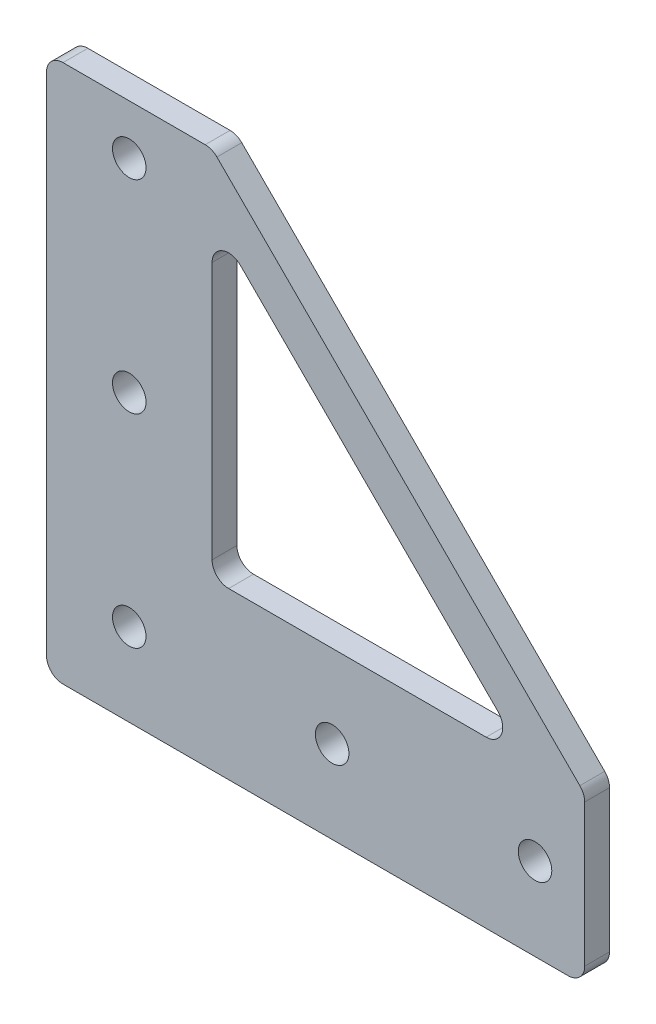
ISO-10303-21;
HEADER;
FILE_DESCRIPTION(('STEP AP214'),'2;1');
FILE_NAME('part.step','',(''),(''),'','','');
FILE_SCHEMA(('AUTOMOTIVE_DESIGN { 1 0 10303 214 1 1 1 1 }'));
ENDSEC;
DATA;
#1=APPLICATION_CONTEXT('core data for automotive mechanical design processes');
#2=APPLICATION_PROTOCOL_DEFINITION('international standard','automotive_design',2000,#1);
#3=PRODUCT_CONTEXT('',#1,'mechanical');
#4=PRODUCT('Part','Part','',(#3));
#5=PRODUCT_RELATED_PRODUCT_CATEGORY('part','',(#4));
#6=PRODUCT_DEFINITION_FORMATION('','',#4);
#7=PRODUCT_DEFINITION_CONTEXT('part definition',#1,'design');
#8=PRODUCT_DEFINITION('design','',#6,#7);
#9=PRODUCT_DEFINITION_SHAPE('','',#8);
#10=(LENGTH_UNIT() NAMED_UNIT(*) SI_UNIT(.MILLI.,.METRE.));
#11=(NAMED_UNIT(*) PLANE_ANGLE_UNIT() SI_UNIT($,.RADIAN.));
#12=(NAMED_UNIT(*) SI_UNIT($,.STERADIAN.) SOLID_ANGLE_UNIT());
#13=UNCERTAINTY_MEASURE_WITH_UNIT(LENGTH_MEASURE(1.E-05),#10,'distance_accuracy_value','');
#14=(GEOMETRIC_REPRESENTATION_CONTEXT(3) GLOBAL_UNCERTAINTY_ASSIGNED_CONTEXT((#13)) GLOBAL_UNIT_ASSIGNED_CONTEXT((#10,
#11,#12)) REPRESENTATION_CONTEXT('',''));
#15=CARTESIAN_POINT('',(0.,0.,0.));
#16=DIRECTION('',(0.,0.,1.));
#17=DIRECTION('',(1.,0.,0.));
#18=AXIS2_PLACEMENT_3D('',#15,#16,#17);
#19=CARTESIAN_POINT('',(65.,0.,3.));
#20=DIRECTION('',(0.,1.,0.));
#21=DIRECTION('',(-1.,0.,0.));
#22=AXIS2_PLACEMENT_3D('',#19,#20,#21);
#23=PLANE('',#22);
#24=DIRECTION('',(1.,0.,0.));
#25=VECTOR('',#24,1.);
#26=CARTESIAN_POINT('',(65.,0.,3.));
#27=LINE('',#26,#25);
#28=CARTESIAN_POINT('',(2.,0.,3.));
#29=VERTEX_POINT('',#28);
#30=CARTESIAN_POINT('',(63.,0.,3.));
#31=VERTEX_POINT('',#30);
#32=EDGE_CURVE('E185',#29,#31,#27,.T.);
#33=ORIENTED_EDGE('',*,*,#32,.F.);
#34=DIRECTION('',(0.,0.,-1.));
#35=VECTOR('',#34,1.);
#36=CARTESIAN_POINT('',(2.,0.,3.));
#37=LINE('',#36,#35);
#38=CARTESIAN_POINT('',(2.,0.,0.));
#39=VERTEX_POINT('',#38);
#40=EDGE_CURVE('E198',#29,#39,#37,.T.);
#41=ORIENTED_EDGE('',*,*,#40,.T.);
#42=DIRECTION('',(1.,0.,0.));
#43=VECTOR('',#42,1.);
#44=CARTESIAN_POINT('',(65.,0.,0.));
#45=LINE('',#44,#43);
#46=CARTESIAN_POINT('',(63.,0.,0.));
#47=VERTEX_POINT('',#46);
#48=EDGE_CURVE('E279',#39,#47,#45,.T.);
#49=ORIENTED_EDGE('',*,*,#48,.T.);
#50=DIRECTION('',(0.,0.,-1.));
#51=VECTOR('',#50,1.);
#52=CARTESIAN_POINT('',(63.,0.,3.));
#53=LINE('',#52,#51);
#54=EDGE_CURVE('E196',#47,#31,#53,.F.);
#55=ORIENTED_EDGE('',*,*,#54,.T.);
#56=EDGE_LOOP('',(#33,#41,#49,#55));
#57=FACE_BOUND('',#56,.T.);
#58=ADVANCED_FACE('F35',(#57),#23,.F.);
#59=CARTESIAN_POINT('',(65.,20.,3.));
#60=DIRECTION('',(-1.,0.,0.));
#61=DIRECTION('',(0.,-1.,0.));
#62=AXIS2_PLACEMENT_3D('',#59,#60,#61);
#63=PLANE('',#62);
#64=DIRECTION('',(0.,1.,0.));
#65=VECTOR('',#64,1.);
#66=CARTESIAN_POINT('',(65.,20.,3.));
#67=LINE('',#66,#65);
#68=CARTESIAN_POINT('',(65.,2.,3.));
#69=VERTEX_POINT('',#68);
#70=CARTESIAN_POINT('',(65.,19.1715728752538,3.));
#71=VERTEX_POINT('',#70);
#72=EDGE_CURVE('E268',#69,#71,#67,.T.);
#73=ORIENTED_EDGE('',*,*,#72,.F.);
#74=DIRECTION('',(0.,0.,-1.));
#75=VECTOR('',#74,1.);
#76=CARTESIAN_POINT('',(65.,2.,3.));
#77=LINE('',#76,#75);
#78=CARTESIAN_POINT('',(65.,2.,0.));
#79=VERTEX_POINT('',#78);
#80=EDGE_CURVE('E236',#69,#79,#77,.T.);
#81=ORIENTED_EDGE('',*,*,#80,.T.);
#82=DIRECTION('',(0.,1.,0.));
#83=VECTOR('',#82,1.);
#84=CARTESIAN_POINT('',(65.,20.,0.));
#85=LINE('',#84,#83);
#86=CARTESIAN_POINT('',(65.,19.1715728752538,0.));
#87=VERTEX_POINT('',#86);
#88=EDGE_CURVE('E180',#79,#87,#85,.T.);
#89=ORIENTED_EDGE('',*,*,#88,.T.);
#90=DIRECTION('',(0.,0.,-1.));
#91=VECTOR('',#90,1.);
#92=CARTESIAN_POINT('',(65.,19.1715728752538,3.));
#93=LINE('',#92,#91);
#94=EDGE_CURVE('E234',#87,#71,#93,.F.);
#95=ORIENTED_EDGE('',*,*,#94,.T.);
#96=EDGE_LOOP('',(#73,#81,#89,#95));
#97=FACE_BOUND('',#96,.T.);
#98=ADVANCED_FACE('F287',(#97),#63,.F.);
#99=CARTESIAN_POINT('',(20.,20.,3.));
#100=DIRECTION('',(0.,-1.,0.));
#101=DIRECTION('',(0.,0.,-1.));
#102=AXIS2_PLACEMENT_3D('',#99,#100,#101);
#103=PLANE('',#102);
#104=DIRECTION('',(-1.,0.,0.));
#105=VECTOR('',#104,1.);
#106=CARTESIAN_POINT('',(20.,20.,3.));
#107=LINE('',#106,#105);
#108=CARTESIAN_POINT('',(53.1005050633883,20.,3.));
#109=VERTEX_POINT('',#108);
#110=CARTESIAN_POINT('',(22.,20.,3.));
#111=VERTEX_POINT('',#110);
#112=EDGE_CURVE('E264',#109,#111,#107,.T.);
#113=ORIENTED_EDGE('',*,*,#112,.F.);
#114=DIRECTION('',(0.,0.,1.));
#115=VECTOR('',#114,1.);
#116=CARTESIAN_POINT('',(53.1005050633883,20.,3.));
#117=LINE('',#116,#115);
#118=CARTESIAN_POINT('',(53.1005050633883,20.,0.));
#119=VERTEX_POINT('',#118);
#120=EDGE_CURVE('E194',#109,#119,#117,.F.);
#121=ORIENTED_EDGE('',*,*,#120,.T.);
#122=DIRECTION('',(-1.,0.,0.));
#123=VECTOR('',#122,1.);
#124=CARTESIAN_POINT('',(20.,20.,0.));
#125=LINE('',#124,#123);
#126=CARTESIAN_POINT('',(22.,20.,0.));
#127=VERTEX_POINT('',#126);
#128=EDGE_CURVE('E176',#119,#127,#125,.T.);
#129=ORIENTED_EDGE('',*,*,#128,.T.);
#130=DIRECTION('',(0.,0.,-1.));
#131=VECTOR('',#130,1.);
#132=CARTESIAN_POINT('',(22.,20.,3.));
#133=LINE('',#132,#131);
#134=EDGE_CURVE('E152',#127,#111,#133,.F.);
#135=ORIENTED_EDGE('',*,*,#134,.T.);
#136=EDGE_LOOP('',(#113,#121,#129,#135));
#137=FACE_BOUND('',#136,.T.);
#138=ADVANCED_FACE('F267',(#137),#103,.F.);
#139=CARTESIAN_POINT('',(20.,65.,3.));
#140=DIRECTION('',(-1.,0.,0.));
#141=DIRECTION('',(0.,-1.,0.));
#142=AXIS2_PLACEMENT_3D('',#139,#140,#141);
#143=PLANE('',#142);
#144=DIRECTION('',(0.,1.,0.));
#145=VECTOR('',#144,1.);
#146=CARTESIAN_POINT('',(20.,65.,0.));
#147=LINE('',#146,#145);
#148=CARTESIAN_POINT('',(20.,22.,0.));
#149=VERTEX_POINT('',#148);
#150=CARTESIAN_POINT('',(20.,53.1005050633883,0.));
#151=VERTEX_POINT('',#150);
#152=EDGE_CURVE('E163',#149,#151,#147,.T.);
#153=ORIENTED_EDGE('',*,*,#152,.T.);
#154=DIRECTION('',(0.,0.,1.));
#155=VECTOR('',#154,1.);
#156=CARTESIAN_POINT('',(20.,53.1005050633883,3.));
#157=LINE('',#156,#155);
#158=CARTESIAN_POINT('',(20.,53.1005050633883,3.));
#159=VERTEX_POINT('',#158);
#160=EDGE_CURVE('E167',#151,#159,#157,.T.);
#161=ORIENTED_EDGE('',*,*,#160,.T.);
#162=DIRECTION('',(0.,1.,0.));
#163=VECTOR('',#162,1.);
#164=CARTESIAN_POINT('',(20.,65.,3.));
#165=LINE('',#164,#163);
#166=CARTESIAN_POINT('',(20.,22.,3.));
#167=VERTEX_POINT('',#166);
#168=EDGE_CURVE('E166',#167,#159,#165,.T.);
#169=ORIENTED_EDGE('',*,*,#168,.F.);
#170=DIRECTION('',(0.,0.,-1.));
#171=VECTOR('',#170,1.);
#172=CARTESIAN_POINT('',(20.,22.,0.));
#173=LINE('',#172,#171);
#174=EDGE_CURVE('E151',#167,#149,#173,.T.);
#175=ORIENTED_EDGE('',*,*,#174,.T.);
#176=EDGE_LOOP('',(#153,#161,#169,#175));
#177=FACE_BOUND('',#176,.T.);
#178=ADVANCED_FACE('F161',(#177),#143,.F.);
#179=CARTESIAN_POINT('',(0.,65.,3.));
#180=DIRECTION('',(0.,-1.,0.));
#181=DIRECTION('',(0.,0.,-1.));
#182=AXIS2_PLACEMENT_3D('',#179,#180,#181);
#183=PLANE('',#182);
#184=DIRECTION('',(-1.,0.,0.));
#185=VECTOR('',#184,1.);
#186=CARTESIAN_POINT('',(0.,65.,0.));
#187=LINE('',#186,#185);
#188=CARTESIAN_POINT('',(19.1715728752538,65.,0.));
#189=VERTEX_POINT('',#188);
#190=CARTESIAN_POINT('',(2.,65.,0.));
#191=VERTEX_POINT('',#190);
#192=EDGE_CURVE('E175',#189,#191,#187,.T.);
#193=ORIENTED_EDGE('',*,*,#192,.T.);
#194=DIRECTION('',(0.,0.,-1.));
#195=VECTOR('',#194,1.);
#196=CARTESIAN_POINT('',(2.,65.,3.));
#197=LINE('',#196,#195);
#198=CARTESIAN_POINT('',(2.,65.,3.));
#199=VERTEX_POINT('',#198);
#200=EDGE_CURVE('E50',#191,#199,#197,.F.);
#201=ORIENTED_EDGE('',*,*,#200,.T.);
#202=DIRECTION('',(-1.,0.,0.));
#203=VECTOR('',#202,1.);
#204=CARTESIAN_POINT('',(0.,65.,3.));
#205=LINE('',#204,#203);
#206=CARTESIAN_POINT('',(19.1715728752538,65.,3.));
#207=VERTEX_POINT('',#206);
#208=EDGE_CURVE('E270',#207,#199,#205,.T.);
#209=ORIENTED_EDGE('',*,*,#208,.F.);
#210=DIRECTION('',(0.,0.,-1.));
#211=VECTOR('',#210,1.);
#212=CARTESIAN_POINT('',(19.1715728752538,65.,0.));
#213=LINE('',#212,#211);
#214=EDGE_CURVE('E225',#207,#189,#213,.T.);
#215=ORIENTED_EDGE('',*,*,#214,.T.);
#216=EDGE_LOOP('',(#193,#201,#209,#215));
#217=FACE_BOUND('',#216,.T.);
#218=ADVANCED_FACE('F354',(#217),#183,.F.);
#219=CARTESIAN_POINT('',(0.,0.,3.));
#220=DIRECTION('',(1.,0.,0.));
#221=DIRECTION('',(0.,0.,-1.));
#222=AXIS2_PLACEMENT_3D('',#219,#220,#221);
#223=PLANE('',#222);
#224=DIRECTION('',(0.,-1.,0.));
#225=VECTOR('',#224,1.);
#226=CARTESIAN_POINT('',(0.,0.,0.));
#227=LINE('',#226,#225);
#228=CARTESIAN_POINT('',(0.,63.,0.));
#229=VERTEX_POINT('',#228);
#230=CARTESIAN_POINT('',(0.,2.,0.));
#231=VERTEX_POINT('',#230);
#232=EDGE_CURVE('E178',#229,#231,#227,.T.);
#233=ORIENTED_EDGE('',*,*,#232,.T.);
#234=DIRECTION('',(0.,0.,-1.));
#235=VECTOR('',#234,1.);
#236=CARTESIAN_POINT('',(0.,2.,3.));
#237=LINE('',#236,#235);
#238=CARTESIAN_POINT('',(0.,2.,3.));
#239=VERTEX_POINT('',#238);
#240=EDGE_CURVE('E214',#231,#239,#237,.F.);
#241=ORIENTED_EDGE('',*,*,#240,.T.);
#242=DIRECTION('',(0.,-1.,0.));
#243=VECTOR('',#242,1.);
#244=CARTESIAN_POINT('',(0.,0.,3.));
#245=LINE('',#244,#243);
#246=CARTESIAN_POINT('',(0.,63.,3.));
#247=VERTEX_POINT('',#246);
#248=EDGE_CURVE('E168',#247,#239,#245,.T.);
#249=ORIENTED_EDGE('',*,*,#248,.F.);
#250=DIRECTION('',(0.,0.,-1.));
#251=VECTOR('',#250,1.);
#252=CARTESIAN_POINT('',(0.,63.,3.));
#253=LINE('',#252,#251);
#254=EDGE_CURVE('E211',#247,#229,#253,.T.);
#255=ORIENTED_EDGE('',*,*,#254,.T.);
#256=EDGE_LOOP('',(#233,#241,#249,#255));
#257=FACE_BOUND('',#256,.T.);
#258=ADVANCED_FACE('F347',(#257),#223,.F.);
#259=CARTESIAN_POINT('',(0.,0.,3.));
#260=DIRECTION('',(0.,0.,-1.));
#261=DIRECTION('',(-1.,0.,0.));
#262=AXIS2_PLACEMENT_3D('',#259,#260,#261);
#263=PLANE('',#262);
#264=ORIENTED_EDGE('',*,*,#168,.T.);
#265=CARTESIAN_POINT('',(22.,53.1005050633883,3.));
#266=DIRECTION('',(0.,0.,-1.));
#267=DIRECTION('',(-1.,0.,0.));
#268=AXIS2_PLACEMENT_3D('',#265,#266,#267);
#269=CIRCLE('',#268,2.);
#270=CARTESIAN_POINT('',(23.4142135623731,54.5147186257614,3.));
#271=VERTEX_POINT('',#270);
#272=EDGE_CURVE('E239',#159,#271,#269,.T.);
#273=ORIENTED_EDGE('',*,*,#272,.T.);
#274=DIRECTION('',(0.707106781186548,-0.707106781186548,0.));
#275=VECTOR('',#274,1.);
#276=CARTESIAN_POINT('',(57.9289321881345,20.,3.));
#277=LINE('',#276,#275);
#278=CARTESIAN_POINT('',(54.5147186257614,23.4142135623731,3.));
#279=VERTEX_POINT('',#278);
#280=EDGE_CURVE('E265',#271,#279,#277,.T.);
#281=ORIENTED_EDGE('',*,*,#280,.T.);
#282=CARTESIAN_POINT('',(53.1005050633883,22.,3.));
#283=DIRECTION('',(0.,0.,-1.));
#284=DIRECTION('',(-1.,0.,0.));
#285=AXIS2_PLACEMENT_3D('',#282,#283,#284);
#286=CIRCLE('',#285,2.);
#287=EDGE_CURVE('E242',#279,#109,#286,.T.);
#288=ORIENTED_EDGE('',*,*,#287,.T.);
#289=ORIENTED_EDGE('',*,*,#112,.T.);
#290=CARTESIAN_POINT('',(22.,22.,3.));
#291=DIRECTION('',(0.,0.,-1.));
#292=DIRECTION('',(-1.,0.,0.));
#293=AXIS2_PLACEMENT_3D('',#290,#291,#292);
#294=CIRCLE('',#293,2.);
#295=EDGE_CURVE('E11',#111,#167,#294,.T.);
#296=ORIENTED_EDGE('',*,*,#295,.T.);
#297=EDGE_LOOP('',(#264,#273,#281,#288,#289,#296));
#298=FACE_BOUND('',#297,.T.);
#299=CARTESIAN_POINT('',(10.,59.,3.));
#300=DIRECTION('',(0.,0.,1.));
#301=DIRECTION('',(1.,0.,0.));
#302=AXIS2_PLACEMENT_3D('',#299,#300,#301);
#303=CIRCLE('',#302,2.025);
#304=CARTESIAN_POINT('',(12.025,59.,3.));
#305=VERTEX_POINT('',#304);
#306=EDGE_CURVE('E307',#305,#305,#303,.T.);
#307=ORIENTED_EDGE('',*,*,#306,.F.);
#308=EDGE_LOOP('',(#307));
#309=FACE_BOUND('',#308,.T.);
#310=CARTESIAN_POINT('',(10.,34.5,3.));
#311=DIRECTION('',(0.,0.,1.));
#312=DIRECTION('',(1.,0.,0.));
#313=AXIS2_PLACEMENT_3D('',#310,#311,#312);
#314=CIRCLE('',#313,2.025);
#315=CARTESIAN_POINT('',(12.025,34.5,3.));
#316=VERTEX_POINT('',#315);
#317=EDGE_CURVE('E313',#316,#316,#314,.T.);
#318=ORIENTED_EDGE('',*,*,#317,.F.);
#319=EDGE_LOOP('',(#318));
#320=FACE_BOUND('',#319,.T.);
#321=CARTESIAN_POINT('',(10.,10.,3.));
#322=DIRECTION('',(0.,0.,1.));
#323=DIRECTION('',(1.,0.,0.));
#324=AXIS2_PLACEMENT_3D('',#321,#322,#323);
#325=CIRCLE('',#324,2.025);
#326=CARTESIAN_POINT('',(12.025,10.,3.));
#327=VERTEX_POINT('',#326);
#328=EDGE_CURVE('E319',#327,#327,#325,.T.);
#329=ORIENTED_EDGE('',*,*,#328,.F.);
#330=EDGE_LOOP('',(#329));
#331=FACE_BOUND('',#330,.T.);
#332=CARTESIAN_POINT('',(34.5,10.,3.));
#333=DIRECTION('',(0.,0.,1.));
#334=DIRECTION('',(1.,0.,0.));
#335=AXIS2_PLACEMENT_3D('',#332,#333,#334);
#336=CIRCLE('',#335,2.025);
#337=CARTESIAN_POINT('',(36.525,10.,3.));
#338=VERTEX_POINT('',#337);
#339=EDGE_CURVE('E325',#338,#338,#336,.T.);
#340=ORIENTED_EDGE('',*,*,#339,.F.);
#341=EDGE_LOOP('',(#340));
#342=FACE_BOUND('',#341,.T.);
#343=CARTESIAN_POINT('',(59.,10.,3.));
#344=DIRECTION('',(0.,0.,1.));
#345=DIRECTION('',(1.,0.,0.));
#346=AXIS2_PLACEMENT_3D('',#343,#344,#345);
#347=CIRCLE('',#346,2.02499999999999);
#348=CARTESIAN_POINT('',(61.025,10.,3.));
#349=VERTEX_POINT('',#348);
#350=EDGE_CURVE('E304',#349,#349,#347,.T.);
#351=ORIENTED_EDGE('',*,*,#350,.F.);
#352=EDGE_LOOP('',(#351));
#353=FACE_BOUND('',#352,.T.);
#354=ORIENTED_EDGE('',*,*,#248,.T.);
#355=CARTESIAN_POINT('',(2.,2.,3.));
#356=DIRECTION('',(0.,0.,-1.));
#357=DIRECTION('',(-1.,0.,0.));
#358=AXIS2_PLACEMENT_3D('',#355,#356,#357);
#359=CIRCLE('',#358,2.);
#360=EDGE_CURVE('E223',#239,#29,#359,.F.);
#361=ORIENTED_EDGE('',*,*,#360,.T.);
#362=ORIENTED_EDGE('',*,*,#32,.T.);
#363=CARTESIAN_POINT('',(63.,2.,3.));
#364=DIRECTION('',(0.,0.,-1.));
#365=DIRECTION('',(-1.,0.,0.));
#366=AXIS2_PLACEMENT_3D('',#363,#364,#365);
#367=CIRCLE('',#366,2.);
#368=EDGE_CURVE('E218',#31,#69,#367,.F.);
#369=ORIENTED_EDGE('',*,*,#368,.T.);
#370=ORIENTED_EDGE('',*,*,#72,.T.);
#371=CARTESIAN_POINT('',(63.,19.1715728752538,3.));
#372=DIRECTION('',(0.,0.,-1.));
#373=DIRECTION('',(-1.,0.,0.));
#374=AXIS2_PLACEMENT_3D('',#371,#372,#373);
#375=CIRCLE('',#374,2.);
#376=CARTESIAN_POINT('',(64.4142135623731,20.5857864376269,3.));
#377=VERTEX_POINT('',#376);
#378=EDGE_CURVE('E216',#71,#377,#375,.F.);
#379=ORIENTED_EDGE('',*,*,#378,.T.);
#380=DIRECTION('',(-0.707106781186547,0.707106781186548,0.));
#381=VECTOR('',#380,1.);
#382=CARTESIAN_POINT('',(20.,65.,3.));
#383=LINE('',#382,#381);
#384=CARTESIAN_POINT('',(20.5857864376269,64.4142135623731,3.));
#385=VERTEX_POINT('',#384);
#386=EDGE_CURVE('E256',#377,#385,#383,.T.);
#387=ORIENTED_EDGE('',*,*,#386,.T.);
#388=CARTESIAN_POINT('',(19.1715728752538,63.,3.));
#389=DIRECTION('',(0.,0.,-1.));
#390=DIRECTION('',(-1.,0.,0.));
#391=AXIS2_PLACEMENT_3D('',#388,#389,#390);
#392=CIRCLE('',#391,2.);
#393=EDGE_CURVE('E57',#385,#207,#392,.F.);
#394=ORIENTED_EDGE('',*,*,#393,.T.);
#395=ORIENTED_EDGE('',*,*,#208,.T.);
#396=CARTESIAN_POINT('',(2.,63.,3.));
#397=DIRECTION('',(0.,0.,-1.));
#398=DIRECTION('',(-1.,0.,0.));
#399=AXIS2_PLACEMENT_3D('',#396,#397,#398);
#400=CIRCLE('',#399,2.);
#401=EDGE_CURVE('E221',#199,#247,#400,.F.);
#402=ORIENTED_EDGE('',*,*,#401,.T.);
#403=EDGE_LOOP('',(#354,#361,#362,#369,#370,#379,#387,#394,#395,#402));
#404=FACE_BOUND('',#403,.T.);
#405=ADVANCED_FACE('F262',(#298,#309,#320,#331,#342,#353,#404),#263,.F.);
#406=CARTESIAN_POINT('',(0.,0.,0.));
#407=DIRECTION('',(0.,0.,-1.));
#408=DIRECTION('',(-1.,0.,0.));
#409=AXIS2_PLACEMENT_3D('',#406,#407,#408);
#410=PLANE('',#409);
#411=ORIENTED_EDGE('',*,*,#128,.F.);
#412=CARTESIAN_POINT('',(53.1005050633883,22.,0.));
#413=DIRECTION('',(0.,0.,-1.));
#414=DIRECTION('',(-1.,0.,0.));
#415=AXIS2_PLACEMENT_3D('',#412,#413,#414);
#416=CIRCLE('',#415,2.);
#417=CARTESIAN_POINT('',(54.5147186257614,23.4142135623731,0.));
#418=VERTEX_POINT('',#417);
#419=EDGE_CURVE('E157',#119,#418,#416,.F.);
#420=ORIENTED_EDGE('',*,*,#419,.T.);
#421=DIRECTION('',(0.707106781186548,-0.707106781186547,0.));
#422=VECTOR('',#421,1.);
#423=CARTESIAN_POINT('',(57.9289321881345,20.,0.));
#424=LINE('',#423,#422);
#425=CARTESIAN_POINT('',(23.4142135623731,54.5147186257614,0.));
#426=VERTEX_POINT('',#425);
#427=EDGE_CURVE('E246',#426,#418,#424,.T.);
#428=ORIENTED_EDGE('',*,*,#427,.F.);
#429=CARTESIAN_POINT('',(22.,53.1005050633883,0.));
#430=DIRECTION('',(0.,0.,-1.));
#431=DIRECTION('',(-1.,0.,0.));
#432=AXIS2_PLACEMENT_3D('',#429,#430,#431);
#433=CIRCLE('',#432,2.);
#434=EDGE_CURVE('E174',#426,#151,#433,.F.);
#435=ORIENTED_EDGE('',*,*,#434,.T.);
#436=ORIENTED_EDGE('',*,*,#152,.F.);
#437=CARTESIAN_POINT('',(22.,22.,0.));
#438=DIRECTION('',(0.,0.,-1.));
#439=DIRECTION('',(-1.,0.,0.));
#440=AXIS2_PLACEMENT_3D('',#437,#438,#439);
#441=CIRCLE('',#440,2.);
#442=EDGE_CURVE('E43',#149,#127,#441,.F.);
#443=ORIENTED_EDGE('',*,*,#442,.T.);
#444=EDGE_LOOP('',(#411,#420,#428,#435,#436,#443));
#445=FACE_BOUND('',#444,.T.);
#446=CARTESIAN_POINT('',(10.,59.,0.));
#447=DIRECTION('',(0.,0.,1.));
#448=DIRECTION('',(1.,0.,0.));
#449=AXIS2_PLACEMENT_3D('',#446,#447,#448);
#450=CIRCLE('',#449,2.025);
#451=CARTESIAN_POINT('',(12.025,59.,0.));
#452=VERTEX_POINT('',#451);
#453=EDGE_CURVE('E281',#452,#452,#450,.T.);
#454=ORIENTED_EDGE('',*,*,#453,.T.);
#455=EDGE_LOOP('',(#454));
#456=FACE_BOUND('',#455,.T.);
#457=CARTESIAN_POINT('',(10.,34.5,0.));
#458=DIRECTION('',(0.,0.,1.));
#459=DIRECTION('',(1.,0.,0.));
#460=AXIS2_PLACEMENT_3D('',#457,#458,#459);
#461=CIRCLE('',#460,2.025);
#462=CARTESIAN_POINT('',(12.025,34.5,0.));
#463=VERTEX_POINT('',#462);
#464=EDGE_CURVE('E310',#463,#463,#461,.T.);
#465=ORIENTED_EDGE('',*,*,#464,.T.);
#466=EDGE_LOOP('',(#465));
#467=FACE_BOUND('',#466,.T.);
#468=CARTESIAN_POINT('',(10.,10.,0.));
#469=DIRECTION('',(0.,0.,1.));
#470=DIRECTION('',(1.,0.,0.));
#471=AXIS2_PLACEMENT_3D('',#468,#469,#470);
#472=CIRCLE('',#471,2.025);
#473=CARTESIAN_POINT('',(12.025,10.,0.));
#474=VERTEX_POINT('',#473);
#475=EDGE_CURVE('E316',#474,#474,#472,.T.);
#476=ORIENTED_EDGE('',*,*,#475,.T.);
#477=EDGE_LOOP('',(#476));
#478=FACE_BOUND('',#477,.T.);
#479=CARTESIAN_POINT('',(34.5,10.,0.));
#480=DIRECTION('',(0.,0.,1.));
#481=DIRECTION('',(1.,0.,0.));
#482=AXIS2_PLACEMENT_3D('',#479,#480,#481);
#483=CIRCLE('',#482,2.025);
#484=CARTESIAN_POINT('',(36.525,10.,0.));
#485=VERTEX_POINT('',#484);
#486=EDGE_CURVE('E322',#485,#485,#483,.T.);
#487=ORIENTED_EDGE('',*,*,#486,.T.);
#488=EDGE_LOOP('',(#487));
#489=FACE_BOUND('',#488,.T.);
#490=CARTESIAN_POINT('',(59.,10.,0.));
#491=DIRECTION('',(0.,0.,1.));
#492=DIRECTION('',(1.,0.,0.));
#493=AXIS2_PLACEMENT_3D('',#490,#491,#492);
#494=CIRCLE('',#493,2.02499999999999);
#495=CARTESIAN_POINT('',(61.025,10.,0.));
#496=VERTEX_POINT('',#495);
#497=EDGE_CURVE('E328',#496,#496,#494,.T.);
#498=ORIENTED_EDGE('',*,*,#497,.T.);
#499=EDGE_LOOP('',(#498));
#500=FACE_BOUND('',#499,.T.);
#501=ORIENTED_EDGE('',*,*,#48,.F.);
#502=CARTESIAN_POINT('',(2.,2.,0.));
#503=DIRECTION('',(0.,0.,-1.));
#504=DIRECTION('',(-1.,0.,0.));
#505=AXIS2_PLACEMENT_3D('',#502,#503,#504);
#506=CIRCLE('',#505,2.);
#507=EDGE_CURVE('E209',#39,#231,#506,.T.);
#508=ORIENTED_EDGE('',*,*,#507,.T.);
#509=ORIENTED_EDGE('',*,*,#232,.F.);
#510=CARTESIAN_POINT('',(2.,63.,0.));
#511=DIRECTION('',(0.,0.,-1.));
#512=DIRECTION('',(-1.,0.,0.));
#513=AXIS2_PLACEMENT_3D('',#510,#511,#512);
#514=CIRCLE('',#513,2.);
#515=EDGE_CURVE('E207',#229,#191,#514,.T.);
#516=ORIENTED_EDGE('',*,*,#515,.T.);
#517=ORIENTED_EDGE('',*,*,#192,.F.);
#518=CARTESIAN_POINT('',(19.1715728752538,63.,0.));
#519=DIRECTION('',(0.,0.,-1.));
#520=DIRECTION('',(-1.,0.,0.));
#521=AXIS2_PLACEMENT_3D('',#518,#519,#520);
#522=CIRCLE('',#521,2.);
#523=CARTESIAN_POINT('',(20.5857864376269,64.4142135623731,0.));
#524=VERTEX_POINT('',#523);
#525=EDGE_CURVE('E205',#189,#524,#522,.T.);
#526=ORIENTED_EDGE('',*,*,#525,.T.);
#527=DIRECTION('',(-0.707106781186547,0.707106781186548,0.));
#528=VECTOR('',#527,1.);
#529=CARTESIAN_POINT('',(20.,65.,0.));
#530=LINE('',#529,#528);
#531=CARTESIAN_POINT('',(64.4142135623731,20.5857864376269,0.));
#532=VERTEX_POINT('',#531);
#533=EDGE_CURVE('E255',#532,#524,#530,.T.);
#534=ORIENTED_EDGE('',*,*,#533,.F.);
#535=CARTESIAN_POINT('',(63.,19.1715728752538,0.));
#536=DIRECTION('',(0.,0.,-1.));
#537=DIRECTION('',(-1.,0.,0.));
#538=AXIS2_PLACEMENT_3D('',#535,#536,#537);
#539=CIRCLE('',#538,2.);
#540=EDGE_CURVE('E201',#532,#87,#539,.T.);
#541=ORIENTED_EDGE('',*,*,#540,.T.);
#542=ORIENTED_EDGE('',*,*,#88,.F.);
#543=CARTESIAN_POINT('',(63.,2.,0.));
#544=DIRECTION('',(0.,0.,-1.));
#545=DIRECTION('',(-1.,0.,0.));
#546=AXIS2_PLACEMENT_3D('',#543,#544,#545);
#547=CIRCLE('',#546,2.);
#548=EDGE_CURVE('E203',#79,#47,#547,.T.);
#549=ORIENTED_EDGE('',*,*,#548,.T.);
#550=EDGE_LOOP('',(#501,#508,#509,#516,#517,#526,#534,#541,#542,#549));
#551=FACE_BOUND('',#550,.T.);
#552=ADVANCED_FACE('F170',(#445,#456,#467,#478,#489,#500,#551),#410,.T.);
#553=CARTESIAN_POINT('',(59.,10.,0.));
#554=DIRECTION('',(0.,0.,1.));
#555=DIRECTION('',(1.,0.,0.));
#556=AXIS2_PLACEMENT_3D('',#553,#554,#555);
#557=CYLINDRICAL_SURFACE('',#556,2.02499999999999);
#558=ORIENTED_EDGE('',*,*,#497,.F.);
#559=EDGE_LOOP('',(#558));
#560=FACE_BOUND('',#559,.T.);
#561=ORIENTED_EDGE('',*,*,#350,.T.);
#562=EDGE_LOOP('',(#561));
#563=FACE_BOUND('',#562,.T.);
#564=ADVANCED_FACE('F450',(#560,#563),#557,.F.);
#565=CARTESIAN_POINT('',(34.5,10.,0.));
#566=DIRECTION('',(0.,0.,1.));
#567=DIRECTION('',(1.,0.,0.));
#568=AXIS2_PLACEMENT_3D('',#565,#566,#567);
#569=CYLINDRICAL_SURFACE('',#568,2.025);
#570=ORIENTED_EDGE('',*,*,#486,.F.);
#571=EDGE_LOOP('',(#570));
#572=FACE_BOUND('',#571,.T.);
#573=ORIENTED_EDGE('',*,*,#339,.T.);
#574=EDGE_LOOP('',(#573));
#575=FACE_BOUND('',#574,.T.);
#576=ADVANCED_FACE('F491',(#572,#575),#569,.F.);
#577=CARTESIAN_POINT('',(10.,10.,0.));
#578=DIRECTION('',(0.,0.,1.));
#579=DIRECTION('',(1.,0.,0.));
#580=AXIS2_PLACEMENT_3D('',#577,#578,#579);
#581=CYLINDRICAL_SURFACE('',#580,2.025);
#582=ORIENTED_EDGE('',*,*,#475,.F.);
#583=EDGE_LOOP('',(#582));
#584=FACE_BOUND('',#583,.T.);
#585=ORIENTED_EDGE('',*,*,#328,.T.);
#586=EDGE_LOOP('',(#585));
#587=FACE_BOUND('',#586,.T.);
#588=ADVANCED_FACE('F482',(#584,#587),#581,.F.);
#589=CARTESIAN_POINT('',(10.,34.5,0.));
#590=DIRECTION('',(0.,0.,1.));
#591=DIRECTION('',(1.,0.,0.));
#592=AXIS2_PLACEMENT_3D('',#589,#590,#591);
#593=CYLINDRICAL_SURFACE('',#592,2.025);
#594=ORIENTED_EDGE('',*,*,#464,.F.);
#595=EDGE_LOOP('',(#594));
#596=FACE_BOUND('',#595,.T.);
#597=ORIENTED_EDGE('',*,*,#317,.T.);
#598=EDGE_LOOP('',(#597));
#599=FACE_BOUND('',#598,.T.);
#600=ADVANCED_FACE('F473',(#596,#599),#593,.F.);
#601=CARTESIAN_POINT('',(10.,59.,0.));
#602=DIRECTION('',(0.,0.,1.));
#603=DIRECTION('',(1.,0.,0.));
#604=AXIS2_PLACEMENT_3D('',#601,#602,#603);
#605=CYLINDRICAL_SURFACE('',#604,2.025);
#606=ORIENTED_EDGE('',*,*,#453,.F.);
#607=EDGE_LOOP('',(#606));
#608=FACE_BOUND('',#607,.T.);
#609=ORIENTED_EDGE('',*,*,#306,.T.);
#610=EDGE_LOOP('',(#609));
#611=FACE_BOUND('',#610,.T.);
#612=ADVANCED_FACE('F441',(#608,#611),#605,.F.);
#613=CARTESIAN_POINT('',(57.9289321881345,20.,-63.6396103067893));
#614=DIRECTION('',(-0.707106781186548,-0.707106781186548,0.));
#615=DIRECTION('',(0.707106781186548,-0.707106781186547,0.));
#616=AXIS2_PLACEMENT_3D('',#613,#614,#615);
#617=PLANE('',#616);
#618=ORIENTED_EDGE('',*,*,#280,.F.);
#619=DIRECTION('',(0.,0.,1.));
#620=VECTOR('',#619,1.);
#621=CARTESIAN_POINT('',(23.4142135623731,54.5147186257614,-63.6396103067893));
#622=LINE('',#621,#620);
#623=EDGE_CURVE('E191',#271,#426,#622,.F.);
#624=ORIENTED_EDGE('',*,*,#623,.T.);
#625=ORIENTED_EDGE('',*,*,#427,.T.);
#626=DIRECTION('',(0.,0.,1.));
#627=VECTOR('',#626,1.);
#628=CARTESIAN_POINT('',(54.5147186257614,23.4142135623731,-63.6396103067893));
#629=LINE('',#628,#627);
#630=EDGE_CURVE('E188',#418,#279,#629,.T.);
#631=ORIENTED_EDGE('',*,*,#630,.T.);
#632=EDGE_LOOP('',(#618,#624,#625,#631));
#633=FACE_BOUND('',#632,.T.);
#634=ADVANCED_FACE('F252',(#633),#617,.T.);
#635=CARTESIAN_POINT('',(20.,65.,-63.6396103067893));
#636=DIRECTION('',(0.707106781186548,0.707106781186547,0.));
#637=DIRECTION('',(-0.707106781186547,0.707106781186548,0.));
#638=AXIS2_PLACEMENT_3D('',#635,#636,#637);
#639=PLANE('',#638);
#640=ORIENTED_EDGE('',*,*,#533,.T.);
#641=DIRECTION('',(0.,0.,-1.));
#642=VECTOR('',#641,1.);
#643=CARTESIAN_POINT('',(20.5857864376269,64.4142135623731,3.));
#644=LINE('',#643,#642);
#645=EDGE_CURVE('E232',#524,#385,#644,.F.);
#646=ORIENTED_EDGE('',*,*,#645,.T.);
#647=ORIENTED_EDGE('',*,*,#386,.F.);
#648=DIRECTION('',(0.,0.,-1.));
#649=VECTOR('',#648,1.);
#650=CARTESIAN_POINT('',(64.4142135623731,20.5857864376269,0.));
#651=LINE('',#650,#649);
#652=EDGE_CURVE('E229',#377,#532,#651,.T.);
#653=ORIENTED_EDGE('',*,*,#652,.T.);
#654=EDGE_LOOP('',(#640,#646,#647,#653));
#655=FACE_BOUND('',#654,.T.);
#656=ADVANCED_FACE('F297',(#655),#639,.T.);
#657=CARTESIAN_POINT('',(22.,53.1005050633883,3.));
#658=DIRECTION('',(0.,0.,1.));
#659=DIRECTION('',(1.,0.,0.));
#660=AXIS2_PLACEMENT_3D('',#657,#658,#659);
#661=CYLINDRICAL_SURFACE('',#660,2.);
#662=ORIENTED_EDGE('',*,*,#434,.F.);
#663=ORIENTED_EDGE('',*,*,#623,.F.);
#664=ORIENTED_EDGE('',*,*,#272,.F.);
#665=ORIENTED_EDGE('',*,*,#160,.F.);
#666=EDGE_LOOP('',(#662,#663,#664,#665));
#667=FACE_BOUND('',#666,.T.);
#668=ADVANCED_FACE('F374',(#667),#661,.F.);
#669=CARTESIAN_POINT('',(53.1005050633883,22.,-63.6396103067893));
#670=DIRECTION('',(0.,0.,1.));
#671=DIRECTION('',(1.,0.,0.));
#672=AXIS2_PLACEMENT_3D('',#669,#670,#671);
#673=CYLINDRICAL_SURFACE('',#672,2.);
#674=ORIENTED_EDGE('',*,*,#419,.F.);
#675=ORIENTED_EDGE('',*,*,#120,.F.);
#676=ORIENTED_EDGE('',*,*,#287,.F.);
#677=ORIENTED_EDGE('',*,*,#630,.F.);
#678=EDGE_LOOP('',(#674,#675,#676,#677));
#679=FACE_BOUND('',#678,.T.);
#680=ADVANCED_FACE('F258',(#679),#673,.F.);
#681=CARTESIAN_POINT('',(2.,2.,3.));
#682=DIRECTION('',(0.,0.,-1.));
#683=DIRECTION('',(-1.,0.,0.));
#684=AXIS2_PLACEMENT_3D('',#681,#682,#683);
#685=CYLINDRICAL_SURFACE('',#684,2.);
#686=ORIENTED_EDGE('',*,*,#360,.F.);
#687=ORIENTED_EDGE('',*,*,#240,.F.);
#688=ORIENTED_EDGE('',*,*,#507,.F.);
#689=ORIENTED_EDGE('',*,*,#40,.F.);
#690=EDGE_LOOP('',(#686,#687,#688,#689));
#691=FACE_BOUND('',#690,.T.);
#692=ADVANCED_FACE('F343',(#691),#685,.T.);
#693=CARTESIAN_POINT('',(2.,63.,3.));
#694=DIRECTION('',(0.,0.,-1.));
#695=DIRECTION('',(-1.,0.,0.));
#696=AXIS2_PLACEMENT_3D('',#693,#694,#695);
#697=CYLINDRICAL_SURFACE('',#696,2.);
#698=ORIENTED_EDGE('',*,*,#401,.F.);
#699=ORIENTED_EDGE('',*,*,#200,.F.);
#700=ORIENTED_EDGE('',*,*,#515,.F.);
#701=ORIENTED_EDGE('',*,*,#254,.F.);
#702=EDGE_LOOP('',(#698,#699,#700,#701));
#703=FACE_BOUND('',#702,.T.);
#704=ADVANCED_FACE('F352',(#703),#697,.T.);
#705=CARTESIAN_POINT('',(19.1715728752538,63.,3.));
#706=DIRECTION('',(0.,0.,1.));
#707=DIRECTION('',(1.,0.,0.));
#708=AXIS2_PLACEMENT_3D('',#705,#706,#707);
#709=CYLINDRICAL_SURFACE('',#708,2.);
#710=ORIENTED_EDGE('',*,*,#393,.F.);
#711=ORIENTED_EDGE('',*,*,#645,.F.);
#712=ORIENTED_EDGE('',*,*,#525,.F.);
#713=ORIENTED_EDGE('',*,*,#214,.F.);
#714=EDGE_LOOP('',(#710,#711,#712,#713));
#715=FACE_BOUND('',#714,.T.);
#716=ADVANCED_FACE('F357',(#715),#709,.T.);
#717=CARTESIAN_POINT('',(63.,2.,3.));
#718=DIRECTION('',(0.,0.,-1.));
#719=DIRECTION('',(-1.,0.,0.));
#720=AXIS2_PLACEMENT_3D('',#717,#718,#719);
#721=CYLINDRICAL_SURFACE('',#720,2.);
#722=ORIENTED_EDGE('',*,*,#368,.F.);
#723=ORIENTED_EDGE('',*,*,#54,.F.);
#724=ORIENTED_EDGE('',*,*,#548,.F.);
#725=ORIENTED_EDGE('',*,*,#80,.F.);
#726=EDGE_LOOP('',(#722,#723,#724,#725));
#727=FACE_BOUND('',#726,.T.);
#728=ADVANCED_FACE('F340',(#727),#721,.T.);
#729=CARTESIAN_POINT('',(63.,19.1715728752538,-63.6396103067893));
#730=DIRECTION('',(0.,0.,1.));
#731=DIRECTION('',(1.,0.,0.));
#732=AXIS2_PLACEMENT_3D('',#729,#730,#731);
#733=CYLINDRICAL_SURFACE('',#732,2.);
#734=ORIENTED_EDGE('',*,*,#378,.F.);
#735=ORIENTED_EDGE('',*,*,#94,.F.);
#736=ORIENTED_EDGE('',*,*,#540,.F.);
#737=ORIENTED_EDGE('',*,*,#652,.F.);
#738=EDGE_LOOP('',(#734,#735,#736,#737));
#739=FACE_BOUND('',#738,.T.);
#740=ADVANCED_FACE('F292',(#739),#733,.T.);
#741=CARTESIAN_POINT('',(22.,22.,3.));
#742=DIRECTION('',(0.,0.,1.));
#743=DIRECTION('',(1.,0.,0.));
#744=AXIS2_PLACEMENT_3D('',#741,#742,#743);
#745=CYLINDRICAL_SURFACE('',#744,2.);
#746=ORIENTED_EDGE('',*,*,#295,.F.);
#747=ORIENTED_EDGE('',*,*,#134,.F.);
#748=ORIENTED_EDGE('',*,*,#442,.F.);
#749=ORIENTED_EDGE('',*,*,#174,.F.);
#750=EDGE_LOOP('',(#746,#747,#748,#749));
#751=FACE_BOUND('',#750,.T.);
#752=ADVANCED_FACE('F37',(#751),#745,.F.);
#753=CLOSED_SHELL('',(#58,#98,#138,#178,#218,#258,#405,#552,#564,#576,#588,#600,#612,#634,#656,
#668,#680,#692,#704,#716,#728,#740,#752));
#754=MANIFOLD_SOLID_BREP('B2',#753);
#755=ADVANCED_BREP_SHAPE_REPRESENTATION('',(#18,#754),#14);
#756=SHAPE_DEFINITION_REPRESENTATION(#9,#755);
ENDSEC;
END-ISO-10303-21;
